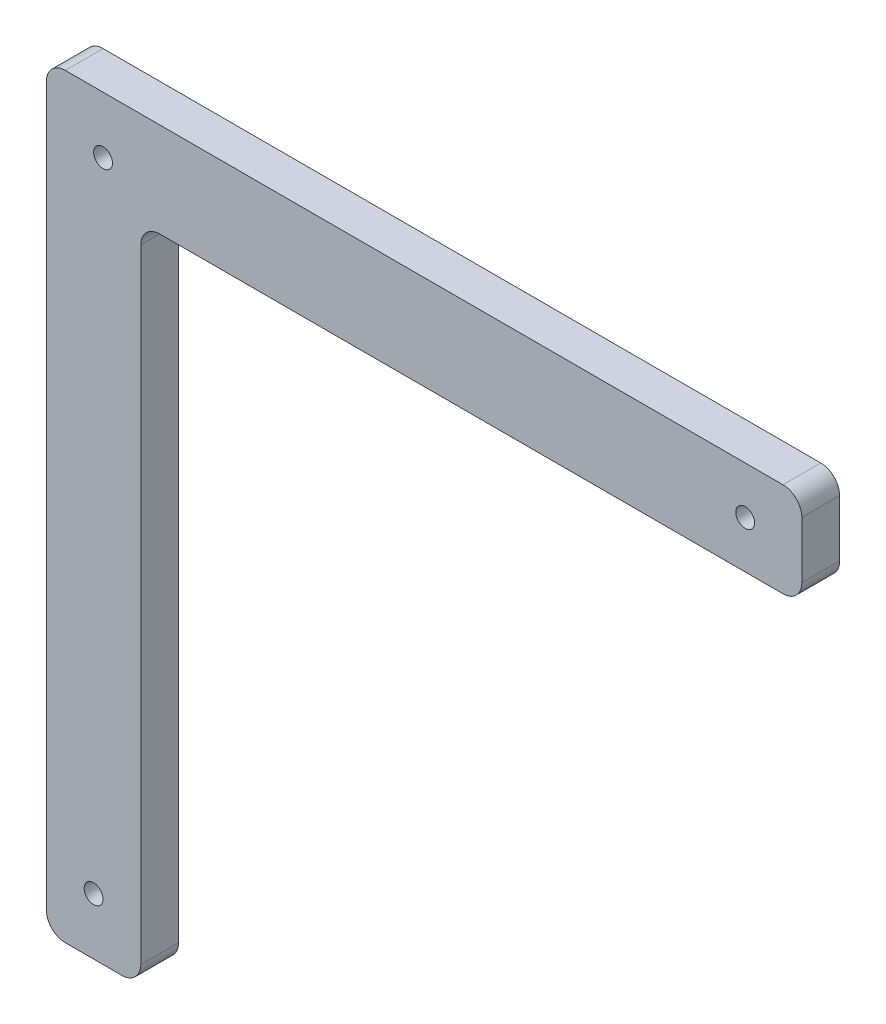
ISO-10303-21;
HEADER;
FILE_DESCRIPTION(('STEP AP214'),'2;1');
FILE_NAME('part.step','',(''),(''),'','','');
FILE_SCHEMA(('AUTOMOTIVE_DESIGN { 1 0 10303 214 1 1 1 1 }'));
ENDSEC;
DATA;
#1=APPLICATION_CONTEXT('core data for automotive mechanical design processes');
#2=APPLICATION_PROTOCOL_DEFINITION('international standard','automotive_design',2000,#1);
#3=PRODUCT_CONTEXT('',#1,'mechanical');
#4=PRODUCT('Part','Part','',(#3));
#5=PRODUCT_RELATED_PRODUCT_CATEGORY('part','',(#4));
#6=PRODUCT_DEFINITION_FORMATION('','',#4);
#7=PRODUCT_DEFINITION_CONTEXT('part definition',#1,'design');
#8=PRODUCT_DEFINITION('design','',#6,#7);
#9=PRODUCT_DEFINITION_SHAPE('','',#8);
#10=(LENGTH_UNIT() NAMED_UNIT(*) SI_UNIT(.MILLI.,.METRE.));
#11=(NAMED_UNIT(*) PLANE_ANGLE_UNIT() SI_UNIT($,.RADIAN.));
#12=(NAMED_UNIT(*) SI_UNIT($,.STERADIAN.) SOLID_ANGLE_UNIT());
#13=UNCERTAINTY_MEASURE_WITH_UNIT(LENGTH_MEASURE(1.E-05),#10,'distance_accuracy_value','');
#14=(GEOMETRIC_REPRESENTATION_CONTEXT(3) GLOBAL_UNCERTAINTY_ASSIGNED_CONTEXT((#13)) GLOBAL_UNIT_ASSIGNED_CONTEXT((#10,
#11,#12)) REPRESENTATION_CONTEXT('',''));
#15=CARTESIAN_POINT('',(0.,0.,0.));
#16=DIRECTION('',(0.,0.,1.));
#17=DIRECTION('',(1.,0.,0.));
#18=AXIS2_PLACEMENT_3D('',#15,#16,#17);
#19=CARTESIAN_POINT('',(50.,0.,20.));
#20=DIRECTION('',(-1.,0.,0.));
#21=DIRECTION('',(0.,0.,1.));
#22=AXIS2_PLACEMENT_3D('',#19,#20,#21);
#23=PLANE('',#22);
#24=DIRECTION('',(0.,1.,0.));
#25=VECTOR('',#24,1.);
#26=CARTESIAN_POINT('',(50.,0.,0.));
#27=LINE('',#26,#25);
#28=CARTESIAN_POINT('',(50.,10.,0.));
#29=VERTEX_POINT('',#28);
#30=CARTESIAN_POINT('',(50.,340.,0.));
#31=VERTEX_POINT('',#30);
#32=EDGE_CURVE('E225',#29,#31,#27,.T.);
#33=ORIENTED_EDGE('',*,*,#32,.T.);
#34=DIRECTION('',(0.,0.,-1.));
#35=VECTOR('',#34,1.);
#36=CARTESIAN_POINT('',(50.,340.,20.));
#37=LINE('',#36,#35);
#38=CARTESIAN_POINT('',(50.,340.,20.));
#39=VERTEX_POINT('',#38);
#40=EDGE_CURVE('E214',#31,#39,#37,.F.);
#41=ORIENTED_EDGE('',*,*,#40,.T.);
#42=DIRECTION('',(0.,1.,0.));
#43=VECTOR('',#42,1.);
#44=CARTESIAN_POINT('',(50.,0.,20.));
#45=LINE('',#44,#43);
#46=CARTESIAN_POINT('',(50.,10.,20.));
#47=VERTEX_POINT('',#46);
#48=EDGE_CURVE('E246',#47,#39,#45,.T.);
#49=ORIENTED_EDGE('',*,*,#48,.F.);
#50=DIRECTION('',(0.,0.,-1.));
#51=VECTOR('',#50,1.);
#52=CARTESIAN_POINT('',(50.,10.,20.));
#53=LINE('',#52,#51);
#54=EDGE_CURVE('E210',#47,#29,#53,.T.);
#55=ORIENTED_EDGE('',*,*,#54,.T.);
#56=EDGE_LOOP('',(#33,#41,#49,#55));
#57=FACE_BOUND('',#56,.T.);
#58=ADVANCED_FACE('F41',(#57),#23,.F.);
#59=CARTESIAN_POINT('',(0.,350.,20.));
#60=DIRECTION('',(0.,1.,0.));
#61=DIRECTION('',(0.,0.,1.));
#62=AXIS2_PLACEMENT_3D('',#59,#60,#61);
#63=PLANE('',#62);
#64=DIRECTION('',(1.,0.,0.));
#65=VECTOR('',#64,1.);
#66=CARTESIAN_POINT('',(0.,350.,0.));
#67=LINE('',#66,#65);
#68=CARTESIAN_POINT('',(60.,350.,0.));
#69=VERTEX_POINT('',#68);
#70=CARTESIAN_POINT('',(390.,350.,0.));
#71=VERTEX_POINT('',#70);
#72=EDGE_CURVE('E227',#69,#71,#67,.T.);
#73=ORIENTED_EDGE('',*,*,#72,.T.);
#74=DIRECTION('',(0.,0.,-1.));
#75=VECTOR('',#74,1.);
#76=CARTESIAN_POINT('',(390.,350.,20.));
#77=LINE('',#76,#75);
#78=CARTESIAN_POINT('',(390.,350.,20.));
#79=VERTEX_POINT('',#78);
#80=EDGE_CURVE('E207',#71,#79,#77,.F.);
#81=ORIENTED_EDGE('',*,*,#80,.T.);
#82=DIRECTION('',(1.,0.,0.));
#83=VECTOR('',#82,1.);
#84=CARTESIAN_POINT('',(0.,350.,20.));
#85=LINE('',#84,#83);
#86=CARTESIAN_POINT('',(60.,350.,20.));
#87=VERTEX_POINT('',#86);
#88=EDGE_CURVE('E244',#87,#79,#85,.T.);
#89=ORIENTED_EDGE('',*,*,#88,.F.);
#90=DIRECTION('',(0.,0.,-1.));
#91=VECTOR('',#90,1.);
#92=CARTESIAN_POINT('',(60.,350.,0.));
#93=LINE('',#92,#91);
#94=EDGE_CURVE('E203',#87,#69,#93,.T.);
#95=ORIENTED_EDGE('',*,*,#94,.T.);
#96=EDGE_LOOP('',(#73,#81,#89,#95));
#97=FACE_BOUND('',#96,.T.);
#98=ADVANCED_FACE('F248',(#97),#63,.F.);
#99=CARTESIAN_POINT('',(400.,0.,20.));
#100=DIRECTION('',(-1.,0.,0.));
#101=DIRECTION('',(0.,0.,1.));
#102=AXIS2_PLACEMENT_3D('',#99,#100,#101);
#103=PLANE('',#102);
#104=DIRECTION('',(0.,1.,0.));
#105=VECTOR('',#104,1.);
#106=CARTESIAN_POINT('',(400.,0.,0.));
#107=LINE('',#106,#105);
#108=CARTESIAN_POINT('',(400.,360.,0.));
#109=VERTEX_POINT('',#108);
#110=CARTESIAN_POINT('',(400.,390.,0.));
#111=VERTEX_POINT('',#110);
#112=EDGE_CURVE('E268',#109,#111,#107,.T.);
#113=ORIENTED_EDGE('',*,*,#112,.T.);
#114=DIRECTION('',(0.,0.,-1.));
#115=VECTOR('',#114,1.);
#116=CARTESIAN_POINT('',(400.,390.,20.));
#117=LINE('',#116,#115);
#118=CARTESIAN_POINT('',(400.,390.,20.));
#119=VERTEX_POINT('',#118);
#120=EDGE_CURVE('E200',#111,#119,#117,.F.);
#121=ORIENTED_EDGE('',*,*,#120,.T.);
#122=DIRECTION('',(0.,1.,0.));
#123=VECTOR('',#122,1.);
#124=CARTESIAN_POINT('',(400.,0.,20.));
#125=LINE('',#124,#123);
#126=CARTESIAN_POINT('',(400.,360.,20.));
#127=VERTEX_POINT('',#126);
#128=EDGE_CURVE('E251',#127,#119,#125,.T.);
#129=ORIENTED_EDGE('',*,*,#128,.F.);
#130=DIRECTION('',(0.,0.,-1.));
#131=VECTOR('',#130,1.);
#132=CARTESIAN_POINT('',(400.,360.,20.));
#133=LINE('',#132,#131);
#134=EDGE_CURVE('E196',#127,#109,#133,.T.);
#135=ORIENTED_EDGE('',*,*,#134,.T.);
#136=EDGE_LOOP('',(#113,#121,#129,#135));
#137=FACE_BOUND('',#136,.T.);
#138=ADVANCED_FACE('F289',(#137),#103,.F.);
#139=CARTESIAN_POINT('',(0.,400.,20.));
#140=DIRECTION('',(0.,1.,0.));
#141=DIRECTION('',(0.,0.,1.));
#142=AXIS2_PLACEMENT_3D('',#139,#140,#141);
#143=PLANE('',#142);
#144=DIRECTION('',(1.,0.,0.));
#145=VECTOR('',#144,1.);
#146=CARTESIAN_POINT('',(0.,400.,0.));
#147=LINE('',#146,#145);
#148=CARTESIAN_POINT('',(9.99999999999998,400.,0.));
#149=VERTEX_POINT('',#148);
#150=CARTESIAN_POINT('',(390.,400.,0.));
#151=VERTEX_POINT('',#150);
#152=EDGE_CURVE('E152',#149,#151,#147,.T.);
#153=ORIENTED_EDGE('',*,*,#152,.F.);
#154=DIRECTION('',(0.,0.,-1.));
#155=VECTOR('',#154,1.);
#156=CARTESIAN_POINT('',(9.99999999999998,400.,20.));
#157=LINE('',#156,#155);
#158=CARTESIAN_POINT('',(9.99999999999998,400.,20.));
#159=VERTEX_POINT('',#158);
#160=EDGE_CURVE('E179',#149,#159,#157,.F.);
#161=ORIENTED_EDGE('',*,*,#160,.T.);
#162=DIRECTION('',(1.,0.,0.));
#163=VECTOR('',#162,1.);
#164=CARTESIAN_POINT('',(0.,400.,20.));
#165=LINE('',#164,#163);
#166=CARTESIAN_POINT('',(390.,400.,20.));
#167=VERTEX_POINT('',#166);
#168=EDGE_CURVE('E256',#159,#167,#165,.T.);
#169=ORIENTED_EDGE('',*,*,#168,.T.);
#170=DIRECTION('',(0.,0.,-1.));
#171=VECTOR('',#170,1.);
#172=CARTESIAN_POINT('',(390.,400.,0.));
#173=LINE('',#172,#171);
#174=EDGE_CURVE('E175',#167,#151,#173,.T.);
#175=ORIENTED_EDGE('',*,*,#174,.T.);
#176=EDGE_LOOP('',(#153,#161,#169,#175));
#177=FACE_BOUND('',#176,.T.);
#178=ADVANCED_FACE('F278',(#177),#143,.T.);
#179=CARTESIAN_POINT('',(0.,0.,20.));
#180=DIRECTION('',(-1.,0.,0.));
#181=DIRECTION('',(0.,-1.,0.));
#182=AXIS2_PLACEMENT_3D('',#179,#180,#181);
#183=PLANE('',#182);
#184=DIRECTION('',(0.,1.,0.));
#185=VECTOR('',#184,1.);
#186=CARTESIAN_POINT('',(0.,0.,20.));
#187=LINE('',#186,#185);
#188=CARTESIAN_POINT('',(0.,10.,20.));
#189=VERTEX_POINT('',#188);
#190=CARTESIAN_POINT('',(0.,390.,20.));
#191=VERTEX_POINT('',#190);
#192=EDGE_CURVE('E160',#189,#191,#187,.T.);
#193=ORIENTED_EDGE('',*,*,#192,.T.);
#194=DIRECTION('',(0.,0.,-1.));
#195=VECTOR('',#194,1.);
#196=CARTESIAN_POINT('',(0.,390.,20.));
#197=LINE('',#196,#195);
#198=CARTESIAN_POINT('',(0.,390.,0.));
#199=VERTEX_POINT('',#198);
#200=EDGE_CURVE('E143',#191,#199,#197,.T.);
#201=ORIENTED_EDGE('',*,*,#200,.T.);
#202=DIRECTION('',(0.,1.,0.));
#203=VECTOR('',#202,1.);
#204=CARTESIAN_POINT('',(0.,0.,0.));
#205=LINE('',#204,#203);
#206=CARTESIAN_POINT('',(0.,10.,0.));
#207=VERTEX_POINT('',#206);
#208=EDGE_CURVE('E135',#207,#199,#205,.T.);
#209=ORIENTED_EDGE('',*,*,#208,.F.);
#210=DIRECTION('',(0.,0.,-1.));
#211=VECTOR('',#210,1.);
#212=CARTESIAN_POINT('',(0.,10.,20.));
#213=LINE('',#212,#211);
#214=EDGE_CURVE('E149',#207,#189,#213,.F.);
#215=ORIENTED_EDGE('',*,*,#214,.T.);
#216=EDGE_LOOP('',(#193,#201,#209,#215));
#217=FACE_BOUND('',#216,.T.);
#218=ADVANCED_FACE('F148',(#217),#183,.T.);
#219=CARTESIAN_POINT('',(0.,0.,20.));
#220=DIRECTION('',(0.,1.,0.));
#221=DIRECTION('',(0.,0.,1.));
#222=AXIS2_PLACEMENT_3D('',#219,#220,#221);
#223=PLANE('',#222);
#224=DIRECTION('',(1.,0.,0.));
#225=VECTOR('',#224,1.);
#226=CARTESIAN_POINT('',(0.,0.,0.));
#227=LINE('',#226,#225);
#228=CARTESIAN_POINT('',(10.,0.,0.));
#229=VERTEX_POINT('',#228);
#230=CARTESIAN_POINT('',(40.,0.,0.));
#231=VERTEX_POINT('',#230);
#232=EDGE_CURVE('E136',#229,#231,#227,.T.);
#233=ORIENTED_EDGE('',*,*,#232,.T.);
#234=DIRECTION('',(0.,0.,-1.));
#235=VECTOR('',#234,1.);
#236=CARTESIAN_POINT('',(40.,0.,20.));
#237=LINE('',#236,#235);
#238=CARTESIAN_POINT('',(40.,0.,20.));
#239=VERTEX_POINT('',#238);
#240=EDGE_CURVE('E57',#231,#239,#237,.F.);
#241=ORIENTED_EDGE('',*,*,#240,.T.);
#242=DIRECTION('',(1.,0.,0.));
#243=VECTOR('',#242,1.);
#244=CARTESIAN_POINT('',(0.,0.,20.));
#245=LINE('',#244,#243);
#246=CARTESIAN_POINT('',(10.,0.,20.));
#247=VERTEX_POINT('',#246);
#248=EDGE_CURVE('E155',#247,#239,#245,.T.);
#249=ORIENTED_EDGE('',*,*,#248,.F.);
#250=DIRECTION('',(0.,0.,-1.));
#251=VECTOR('',#250,1.);
#252=CARTESIAN_POINT('',(10.,0.,0.));
#253=LINE('',#252,#251);
#254=EDGE_CURVE('E217',#247,#229,#253,.T.);
#255=ORIENTED_EDGE('',*,*,#254,.T.);
#256=EDGE_LOOP('',(#233,#241,#249,#255));
#257=FACE_BOUND('',#256,.T.);
#258=ADVANCED_FACE('F319',(#257),#223,.F.);
#259=CARTESIAN_POINT('',(0.,0.,20.));
#260=DIRECTION('',(0.,0.,1.));
#261=DIRECTION('',(1.,0.,0.));
#262=AXIS2_PLACEMENT_3D('',#259,#260,#261);
#263=PLANE('',#262);
#264=CARTESIAN_POINT('',(25.,30.,20.));
#265=DIRECTION('',(0.,0.,1.));
#266=DIRECTION('',(1.,0.,0.));
#267=AXIS2_PLACEMENT_3D('',#264,#265,#266);
#268=CIRCLE('',#267,5.);
#269=CARTESIAN_POINT('',(30.,30.,20.));
#270=VERTEX_POINT('',#269);
#271=EDGE_CURVE('E402',#270,#270,#268,.T.);
#272=ORIENTED_EDGE('',*,*,#271,.F.);
#273=EDGE_LOOP('',(#272));
#274=FACE_BOUND('',#273,.T.);
#275=CARTESIAN_POINT('',(30.,370.,20.));
#276=DIRECTION('',(0.,0.,1.));
#277=DIRECTION('',(1.,0.,0.));
#278=AXIS2_PLACEMENT_3D('',#275,#276,#277);
#279=CIRCLE('',#278,5.00000000000001);
#280=CARTESIAN_POINT('',(35.,370.,20.));
#281=VERTEX_POINT('',#280);
#282=EDGE_CURVE('E410',#281,#281,#279,.T.);
#283=ORIENTED_EDGE('',*,*,#282,.F.);
#284=EDGE_LOOP('',(#283));
#285=FACE_BOUND('',#284,.T.);
#286=CARTESIAN_POINT('',(370.,375.,20.));
#287=DIRECTION('',(0.,0.,1.));
#288=DIRECTION('',(1.,0.,0.));
#289=AXIS2_PLACEMENT_3D('',#286,#287,#288);
#290=CIRCLE('',#289,4.99999999999999);
#291=CARTESIAN_POINT('',(375.,375.,20.));
#292=VERTEX_POINT('',#291);
#293=EDGE_CURVE('E419',#292,#292,#290,.T.);
#294=ORIENTED_EDGE('',*,*,#293,.F.);
#295=EDGE_LOOP('',(#294));
#296=FACE_BOUND('',#295,.T.);
#297=ORIENTED_EDGE('',*,*,#168,.F.);
#298=CARTESIAN_POINT('',(9.99999999999998,390.,20.));
#299=DIRECTION('',(0.,0.,1.));
#300=DIRECTION('',(1.,0.,0.));
#301=AXIS2_PLACEMENT_3D('',#298,#299,#300);
#302=CIRCLE('',#301,10.);
#303=EDGE_CURVE('E193',#159,#191,#302,.T.);
#304=ORIENTED_EDGE('',*,*,#303,.T.);
#305=ORIENTED_EDGE('',*,*,#192,.F.);
#306=CARTESIAN_POINT('',(10.,10.,20.));
#307=DIRECTION('',(0.,0.,1.));
#308=DIRECTION('',(1.,0.,0.));
#309=AXIS2_PLACEMENT_3D('',#306,#307,#308);
#310=CIRCLE('',#309,10.);
#311=EDGE_CURVE('E64',#189,#247,#310,.T.);
#312=ORIENTED_EDGE('',*,*,#311,.T.);
#313=ORIENTED_EDGE('',*,*,#248,.T.);
#314=CARTESIAN_POINT('',(40.,10.,20.));
#315=DIRECTION('',(0.,0.,1.));
#316=DIRECTION('',(1.,0.,0.));
#317=AXIS2_PLACEMENT_3D('',#314,#315,#316);
#318=CIRCLE('',#317,10.);
#319=EDGE_CURVE('E184',#239,#47,#318,.T.);
#320=ORIENTED_EDGE('',*,*,#319,.T.);
#321=ORIENTED_EDGE('',*,*,#48,.T.);
#322=CARTESIAN_POINT('',(60.,340.,20.));
#323=DIRECTION('',(0.,0.,1.));
#324=DIRECTION('',(1.,0.,0.));
#325=AXIS2_PLACEMENT_3D('',#322,#323,#324);
#326=CIRCLE('',#325,10.);
#327=EDGE_CURVE('E11',#39,#87,#326,.F.);
#328=ORIENTED_EDGE('',*,*,#327,.T.);
#329=ORIENTED_EDGE('',*,*,#88,.T.);
#330=CARTESIAN_POINT('',(390.,360.,20.));
#331=DIRECTION('',(0.,0.,1.));
#332=DIRECTION('',(1.,0.,0.));
#333=AXIS2_PLACEMENT_3D('',#330,#331,#332);
#334=CIRCLE('',#333,10.);
#335=EDGE_CURVE('E187',#79,#127,#334,.T.);
#336=ORIENTED_EDGE('',*,*,#335,.T.);
#337=ORIENTED_EDGE('',*,*,#128,.T.);
#338=CARTESIAN_POINT('',(390.,390.,20.));
#339=DIRECTION('',(0.,0.,1.));
#340=DIRECTION('',(1.,0.,0.));
#341=AXIS2_PLACEMENT_3D('',#338,#339,#340);
#342=CIRCLE('',#341,10.);
#343=EDGE_CURVE('E190',#119,#167,#342,.T.);
#344=ORIENTED_EDGE('',*,*,#343,.T.);
#345=EDGE_LOOP('',(#297,#304,#305,#312,#313,#320,#321,#328,#329,#336,#337,#344));
#346=FACE_BOUND('',#345,.T.);
#347=ADVANCED_FACE('F243',(#274,#285,#296,#346),#263,.T.);
#348=CARTESIAN_POINT('',(0.,0.,0.));
#349=DIRECTION('',(0.,0.,1.));
#350=DIRECTION('',(1.,0.,0.));
#351=AXIS2_PLACEMENT_3D('',#348,#349,#350);
#352=PLANE('',#351);
#353=CARTESIAN_POINT('',(25.,30.,0.));
#354=DIRECTION('',(0.,0.,1.));
#355=DIRECTION('',(1.,0.,0.));
#356=AXIS2_PLACEMENT_3D('',#353,#354,#355);
#357=CIRCLE('',#356,5.);
#358=CARTESIAN_POINT('',(30.,30.,0.));
#359=VERTEX_POINT('',#358);
#360=EDGE_CURVE('E236',#359,#359,#357,.T.);
#361=ORIENTED_EDGE('',*,*,#360,.T.);
#362=EDGE_LOOP('',(#361));
#363=FACE_BOUND('',#362,.T.);
#364=CARTESIAN_POINT('',(30.,370.,0.));
#365=DIRECTION('',(0.,0.,1.));
#366=DIRECTION('',(1.,0.,0.));
#367=AXIS2_PLACEMENT_3D('',#364,#365,#366);
#368=CIRCLE('',#367,5.00000000000001);
#369=CARTESIAN_POINT('',(35.,370.,0.));
#370=VERTEX_POINT('',#369);
#371=EDGE_CURVE('E404',#370,#370,#368,.T.);
#372=ORIENTED_EDGE('',*,*,#371,.T.);
#373=EDGE_LOOP('',(#372));
#374=FACE_BOUND('',#373,.T.);
#375=CARTESIAN_POINT('',(370.,375.,0.));
#376=DIRECTION('',(0.,0.,1.));
#377=DIRECTION('',(1.,0.,0.));
#378=AXIS2_PLACEMENT_3D('',#375,#376,#377);
#379=CIRCLE('',#378,4.99999999999999);
#380=CARTESIAN_POINT('',(375.,375.,0.));
#381=VERTEX_POINT('',#380);
#382=EDGE_CURVE('E416',#381,#381,#379,.T.);
#383=ORIENTED_EDGE('',*,*,#382,.T.);
#384=EDGE_LOOP('',(#383));
#385=FACE_BOUND('',#384,.T.);
#386=ORIENTED_EDGE('',*,*,#208,.T.);
#387=CARTESIAN_POINT('',(9.99999999999998,390.,0.));
#388=DIRECTION('',(0.,0.,1.));
#389=DIRECTION('',(1.,0.,0.));
#390=AXIS2_PLACEMENT_3D('',#387,#388,#389);
#391=CIRCLE('',#390,10.);
#392=EDGE_CURVE('E172',#199,#149,#391,.F.);
#393=ORIENTED_EDGE('',*,*,#392,.T.);
#394=ORIENTED_EDGE('',*,*,#152,.T.);
#395=CARTESIAN_POINT('',(390.,390.,0.));
#396=DIRECTION('',(0.,0.,1.));
#397=DIRECTION('',(1.,0.,0.));
#398=AXIS2_PLACEMENT_3D('',#395,#396,#397);
#399=CIRCLE('',#398,10.);
#400=EDGE_CURVE('E169',#151,#111,#399,.F.);
#401=ORIENTED_EDGE('',*,*,#400,.T.);
#402=ORIENTED_EDGE('',*,*,#112,.F.);
#403=CARTESIAN_POINT('',(390.,360.,0.));
#404=DIRECTION('',(0.,0.,1.));
#405=DIRECTION('',(1.,0.,0.));
#406=AXIS2_PLACEMENT_3D('',#403,#404,#405);
#407=CIRCLE('',#406,10.);
#408=EDGE_CURVE('E166',#109,#71,#407,.F.);
#409=ORIENTED_EDGE('',*,*,#408,.T.);
#410=ORIENTED_EDGE('',*,*,#72,.F.);
#411=CARTESIAN_POINT('',(60.,340.,0.));
#412=DIRECTION('',(0.,0.,1.));
#413=DIRECTION('',(1.,0.,0.));
#414=AXIS2_PLACEMENT_3D('',#411,#412,#413);
#415=CIRCLE('',#414,10.);
#416=EDGE_CURVE('E50',#69,#31,#415,.T.);
#417=ORIENTED_EDGE('',*,*,#416,.T.);
#418=ORIENTED_EDGE('',*,*,#32,.F.);
#419=CARTESIAN_POINT('',(40.,10.,0.));
#420=DIRECTION('',(0.,0.,1.));
#421=DIRECTION('',(1.,0.,0.));
#422=AXIS2_PLACEMENT_3D('',#419,#420,#421);
#423=CIRCLE('',#422,10.);
#424=EDGE_CURVE('E142',#29,#231,#423,.F.);
#425=ORIENTED_EDGE('',*,*,#424,.T.);
#426=ORIENTED_EDGE('',*,*,#232,.F.);
#427=CARTESIAN_POINT('',(10.,10.,0.));
#428=DIRECTION('',(0.,0.,1.));
#429=DIRECTION('',(1.,0.,0.));
#430=AXIS2_PLACEMENT_3D('',#427,#428,#429);
#431=CIRCLE('',#430,10.);
#432=EDGE_CURVE('E132',#229,#207,#431,.F.);
#433=ORIENTED_EDGE('',*,*,#432,.T.);
#434=EDGE_LOOP('',(#386,#393,#394,#401,#402,#409,#410,#417,#418,#425,#426,#433));
#435=FACE_BOUND('',#434,.T.);
#436=ADVANCED_FACE('F134',(#363,#374,#385,#435),#352,.F.);
#437=CARTESIAN_POINT('',(9.99999999999998,390.,20.));
#438=DIRECTION('',(0.,0.,-1.));
#439=DIRECTION('',(-1.,0.,0.));
#440=AXIS2_PLACEMENT_3D('',#437,#438,#439);
#441=CYLINDRICAL_SURFACE('',#440,10.);
#442=ORIENTED_EDGE('',*,*,#303,.F.);
#443=ORIENTED_EDGE('',*,*,#160,.F.);
#444=ORIENTED_EDGE('',*,*,#392,.F.);
#445=ORIENTED_EDGE('',*,*,#200,.F.);
#446=EDGE_LOOP('',(#442,#443,#444,#445));
#447=FACE_BOUND('',#446,.T.);
#448=ADVANCED_FACE('F282',(#447),#441,.T.);
#449=CARTESIAN_POINT('',(390.,390.,20.));
#450=DIRECTION('',(0.,0.,1.));
#451=DIRECTION('',(1.,0.,0.));
#452=AXIS2_PLACEMENT_3D('',#449,#450,#451);
#453=CYLINDRICAL_SURFACE('',#452,10.);
#454=ORIENTED_EDGE('',*,*,#343,.F.);
#455=ORIENTED_EDGE('',*,*,#120,.F.);
#456=ORIENTED_EDGE('',*,*,#400,.F.);
#457=ORIENTED_EDGE('',*,*,#174,.F.);
#458=EDGE_LOOP('',(#454,#455,#456,#457));
#459=FACE_BOUND('',#458,.T.);
#460=ADVANCED_FACE('F285',(#459),#453,.T.);
#461=CARTESIAN_POINT('',(390.,360.,20.));
#462=DIRECTION('',(0.,0.,-1.));
#463=DIRECTION('',(-1.,0.,0.));
#464=AXIS2_PLACEMENT_3D('',#461,#462,#463);
#465=CYLINDRICAL_SURFACE('',#464,10.);
#466=ORIENTED_EDGE('',*,*,#335,.F.);
#467=ORIENTED_EDGE('',*,*,#80,.F.);
#468=ORIENTED_EDGE('',*,*,#408,.F.);
#469=ORIENTED_EDGE('',*,*,#134,.F.);
#470=EDGE_LOOP('',(#466,#467,#468,#469));
#471=FACE_BOUND('',#470,.T.);
#472=ADVANCED_FACE('F292',(#471),#465,.T.);
#473=CARTESIAN_POINT('',(60.,340.,20.));
#474=DIRECTION('',(0.,0.,1.));
#475=DIRECTION('',(1.,0.,0.));
#476=AXIS2_PLACEMENT_3D('',#473,#474,#475);
#477=CYLINDRICAL_SURFACE('',#476,10.);
#478=ORIENTED_EDGE('',*,*,#327,.F.);
#479=ORIENTED_EDGE('',*,*,#40,.F.);
#480=ORIENTED_EDGE('',*,*,#416,.F.);
#481=ORIENTED_EDGE('',*,*,#94,.F.);
#482=EDGE_LOOP('',(#478,#479,#480,#481));
#483=FACE_BOUND('',#482,.T.);
#484=ADVANCED_FACE('F239',(#483),#477,.F.);
#485=CARTESIAN_POINT('',(40.,10.,20.));
#486=DIRECTION('',(0.,0.,-1.));
#487=DIRECTION('',(-1.,0.,0.));
#488=AXIS2_PLACEMENT_3D('',#485,#486,#487);
#489=CYLINDRICAL_SURFACE('',#488,10.);
#490=ORIENTED_EDGE('',*,*,#319,.F.);
#491=ORIENTED_EDGE('',*,*,#240,.F.);
#492=ORIENTED_EDGE('',*,*,#424,.F.);
#493=ORIENTED_EDGE('',*,*,#54,.F.);
#494=EDGE_LOOP('',(#490,#491,#492,#493));
#495=FACE_BOUND('',#494,.T.);
#496=ADVANCED_FACE('F299',(#495),#489,.T.);
#497=CARTESIAN_POINT('',(10.,10.,20.));
#498=DIRECTION('',(0.,0.,1.));
#499=DIRECTION('',(1.,0.,0.));
#500=AXIS2_PLACEMENT_3D('',#497,#498,#499);
#501=CYLINDRICAL_SURFACE('',#500,10.);
#502=ORIENTED_EDGE('',*,*,#311,.F.);
#503=ORIENTED_EDGE('',*,*,#214,.F.);
#504=ORIENTED_EDGE('',*,*,#432,.F.);
#505=ORIENTED_EDGE('',*,*,#254,.F.);
#506=EDGE_LOOP('',(#502,#503,#504,#505));
#507=FACE_BOUND('',#506,.T.);
#508=ADVANCED_FACE('F43',(#507),#501,.T.);
#509=CARTESIAN_POINT('',(370.,375.,0.));
#510=DIRECTION('',(0.,0.,1.));
#511=DIRECTION('',(1.,0.,0.));
#512=AXIS2_PLACEMENT_3D('',#509,#510,#511);
#513=CYLINDRICAL_SURFACE('',#512,4.99999999999999);
#514=ORIENTED_EDGE('',*,*,#382,.F.);
#515=EDGE_LOOP('',(#514));
#516=FACE_BOUND('',#515,.T.);
#517=ORIENTED_EDGE('',*,*,#293,.T.);
#518=EDGE_LOOP('',(#517));
#519=FACE_BOUND('',#518,.T.);
#520=ADVANCED_FACE('F370',(#516,#519),#513,.F.);
#521=CARTESIAN_POINT('',(30.,370.,0.));
#522=DIRECTION('',(0.,0.,1.));
#523=DIRECTION('',(1.,0.,0.));
#524=AXIS2_PLACEMENT_3D('',#521,#522,#523);
#525=CYLINDRICAL_SURFACE('',#524,5.00000000000001);
#526=ORIENTED_EDGE('',*,*,#371,.F.);
#527=EDGE_LOOP('',(#526));
#528=FACE_BOUND('',#527,.T.);
#529=ORIENTED_EDGE('',*,*,#282,.T.);
#530=EDGE_LOOP('',(#529));
#531=FACE_BOUND('',#530,.T.);
#532=ADVANCED_FACE('F375',(#528,#531),#525,.F.);
#533=CARTESIAN_POINT('',(25.,30.,0.));
#534=DIRECTION('',(0.,0.,1.));
#535=DIRECTION('',(1.,0.,0.));
#536=AXIS2_PLACEMENT_3D('',#533,#534,#535);
#537=CYLINDRICAL_SURFACE('',#536,5.);
#538=ORIENTED_EDGE('',*,*,#360,.F.);
#539=EDGE_LOOP('',(#538));
#540=FACE_BOUND('',#539,.T.);
#541=ORIENTED_EDGE('',*,*,#271,.T.);
#542=EDGE_LOOP('',(#541));
#543=FACE_BOUND('',#542,.T.);
#544=ADVANCED_FACE('F384',(#540,#543),#537,.F.);
#545=CLOSED_SHELL('',(#58,#98,#138,#178,#218,#258,#347,#436,#448,#460,#472,#484,#496,#508,#520,
#532,#544));
#546=MANIFOLD_SOLID_BREP('B2',#545);
#547=ADVANCED_BREP_SHAPE_REPRESENTATION('',(#18,#546),#14);
#548=SHAPE_DEFINITION_REPRESENTATION(#9,#547);
ENDSEC;
END-ISO-10303-21;
